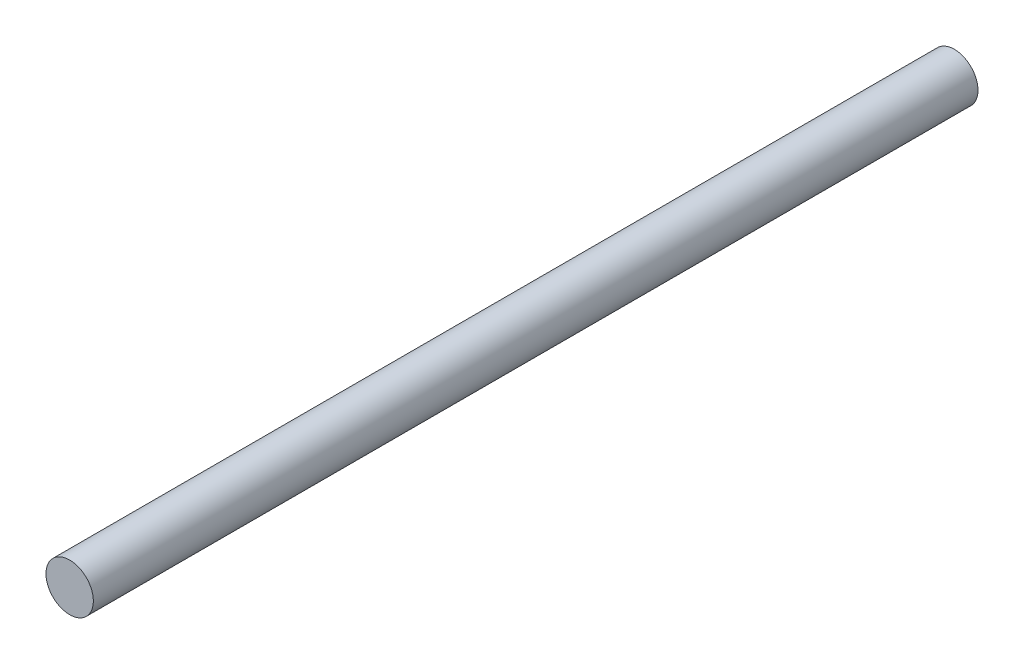
ISO-10303-21;
HEADER;
FILE_DESCRIPTION(('STEP AP214'),'2;1');
FILE_NAME('part.step','',(''),(''),'','','');
FILE_SCHEMA(('AUTOMOTIVE_DESIGN { 1 0 10303 214 1 1 1 1 }'));
ENDSEC;
DATA;
#1=APPLICATION_CONTEXT('core data for automotive mechanical design processes');
#2=APPLICATION_PROTOCOL_DEFINITION('international standard','automotive_design',2000,#1);
#3=PRODUCT_CONTEXT('',#1,'mechanical');
#4=PRODUCT('Part','Part','',(#3));
#5=PRODUCT_RELATED_PRODUCT_CATEGORY('part','',(#4));
#6=PRODUCT_DEFINITION_FORMATION('','',#4);
#7=PRODUCT_DEFINITION_CONTEXT('part definition',#1,'design');
#8=PRODUCT_DEFINITION('design','',#6,#7);
#9=PRODUCT_DEFINITION_SHAPE('','',#8);
#10=(LENGTH_UNIT() NAMED_UNIT(*) SI_UNIT(.MILLI.,.METRE.));
#11=(NAMED_UNIT(*) PLANE_ANGLE_UNIT() SI_UNIT($,.RADIAN.));
#12=(NAMED_UNIT(*) SI_UNIT($,.STERADIAN.) SOLID_ANGLE_UNIT());
#13=UNCERTAINTY_MEASURE_WITH_UNIT(LENGTH_MEASURE(1.E-05),#10,'distance_accuracy_value','');
#14=(GEOMETRIC_REPRESENTATION_CONTEXT(3) GLOBAL_UNCERTAINTY_ASSIGNED_CONTEXT((#13)) GLOBAL_UNIT_ASSIGNED_CONTEXT((#10,
#11,#12)) REPRESENTATION_CONTEXT('',''));
#15=CARTESIAN_POINT('',(0.,0.,0.));
#16=DIRECTION('',(0.,0.,1.));
#17=DIRECTION('',(1.,0.,0.));
#18=AXIS2_PLACEMENT_3D('',#15,#16,#17);
#19=CARTESIAN_POINT('',(0.,0.,560.));
#20=DIRECTION('',(0.,0.,-1.));
#21=DIRECTION('',(-1.,0.,0.));
#22=AXIS2_PLACEMENT_3D('',#19,#20,#21);
#23=CYLINDRICAL_SURFACE('',#22,15.);
#24=CARTESIAN_POINT('',(0.,0.,560.));
#25=DIRECTION('',(0.,0.,1.));
#26=DIRECTION('',(1.,0.,0.));
#27=AXIS2_PLACEMENT_3D('',#24,#25,#26);
#28=CIRCLE('',#27,15.);
#29=CARTESIAN_POINT('',(15.,0.,560.));
#30=VERTEX_POINT('',#29);
#31=EDGE_CURVE('E10',#30,#30,#28,.T.);
#32=ORIENTED_EDGE('',*,*,#31,.F.);
#33=EDGE_LOOP('',(#32));
#34=FACE_BOUND('',#33,.T.);
#35=CARTESIAN_POINT('',(0.,0.,0.));
#36=DIRECTION('',(0.,0.,1.));
#37=DIRECTION('',(1.,0.,0.));
#38=AXIS2_PLACEMENT_3D('',#35,#36,#37);
#39=CIRCLE('',#38,15.);
#40=CARTESIAN_POINT('',(15.,0.,0.));
#41=VERTEX_POINT('',#40);
#42=EDGE_CURVE('E34',#41,#41,#39,.T.);
#43=ORIENTED_EDGE('',*,*,#42,.T.);
#44=EDGE_LOOP('',(#43));
#45=FACE_BOUND('',#44,.T.);
#46=ADVANCED_FACE('F31',(#34,#45),#23,.T.);
#47=CARTESIAN_POINT('',(0.,0.,560.));
#48=DIRECTION('',(0.,0.,1.));
#49=DIRECTION('',(1.,0.,0.));
#50=AXIS2_PLACEMENT_3D('',#47,#48,#49);
#51=PLANE('',#50);
#52=ORIENTED_EDGE('',*,*,#31,.T.);
#53=EDGE_LOOP('',(#52));
#54=FACE_BOUND('',#53,.T.);
#55=ADVANCED_FACE('F46',(#54),#51,.T.);
#56=CARTESIAN_POINT('',(0.,0.,0.));
#57=DIRECTION('',(0.,0.,1.));
#58=DIRECTION('',(1.,0.,0.));
#59=AXIS2_PLACEMENT_3D('',#56,#57,#58);
#60=PLANE('',#59);
#61=ORIENTED_EDGE('',*,*,#42,.F.);
#62=EDGE_LOOP('',(#61));
#63=FACE_BOUND('',#62,.T.);
#64=ADVANCED_FACE('F44',(#63),#60,.F.);
#65=CLOSED_SHELL('',(#46,#55,#64));
#66=MANIFOLD_SOLID_BREP('B2',#65);
#67=ADVANCED_BREP_SHAPE_REPRESENTATION('',(#18,#66),#14);
#68=SHAPE_DEFINITION_REPRESENTATION(#9,#67);
ENDSEC;
END-ISO-10303-21;
